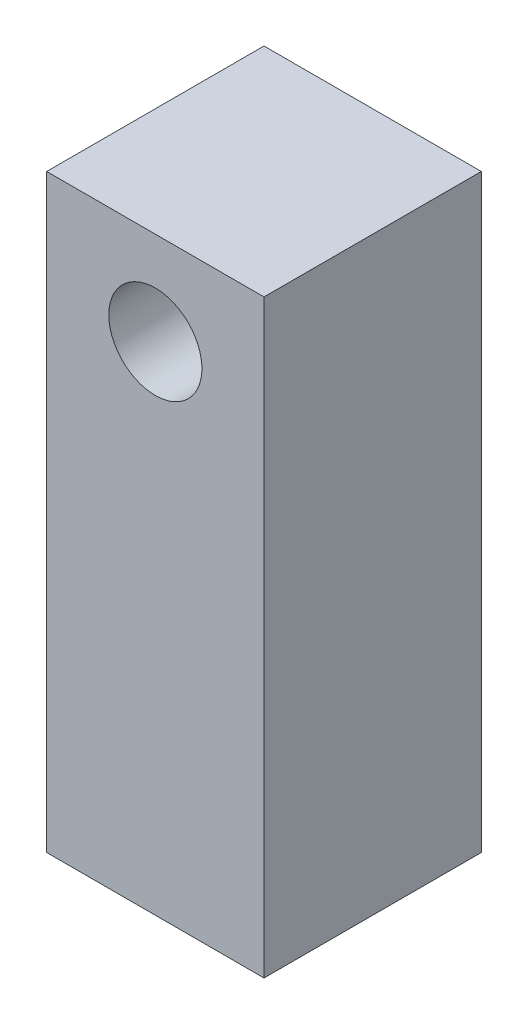
ISO-10303-21;
HEADER;
FILE_DESCRIPTION(('STEP AP214'),'2;1');
FILE_NAME('part.step','',(''),(''),'','','');
FILE_SCHEMA(('AUTOMOTIVE_DESIGN { 1 0 10303 214 1 1 1 1 }'));
ENDSEC;
DATA;
#1=APPLICATION_CONTEXT('core data for automotive mechanical design processes');
#2=APPLICATION_PROTOCOL_DEFINITION('international standard','automotive_design',2000,#1);
#3=PRODUCT_CONTEXT('',#1,'mechanical');
#4=PRODUCT('Part','Part','',(#3));
#5=PRODUCT_RELATED_PRODUCT_CATEGORY('part','',(#4));
#6=PRODUCT_DEFINITION_FORMATION('','',#4);
#7=PRODUCT_DEFINITION_CONTEXT('part definition',#1,'design');
#8=PRODUCT_DEFINITION('design','',#6,#7);
#9=PRODUCT_DEFINITION_SHAPE('','',#8);
#10=(LENGTH_UNIT() NAMED_UNIT(*) SI_UNIT(.MILLI.,.METRE.));
#11=(NAMED_UNIT(*) PLANE_ANGLE_UNIT() SI_UNIT($,.RADIAN.));
#12=(NAMED_UNIT(*) SI_UNIT($,.STERADIAN.) SOLID_ANGLE_UNIT());
#13=UNCERTAINTY_MEASURE_WITH_UNIT(LENGTH_MEASURE(1.E-05),#10,'distance_accuracy_value','');
#14=(GEOMETRIC_REPRESENTATION_CONTEXT(3) GLOBAL_UNCERTAINTY_ASSIGNED_CONTEXT((#13)) GLOBAL_UNIT_ASSIGNED_CONTEXT((#10,
#11,#12)) REPRESENTATION_CONTEXT('',''));
#15=CARTESIAN_POINT('',(0.,0.,0.));
#16=DIRECTION('',(0.,0.,1.));
#17=DIRECTION('',(1.,0.,0.));
#18=AXIS2_PLACEMENT_3D('',#15,#16,#17);
#19=CARTESIAN_POINT('',(0.,0.,0.));
#20=DIRECTION('',(0.,-1.,0.));
#21=DIRECTION('',(0.,0.,-1.));
#22=AXIS2_PLACEMENT_3D('',#19,#20,#21);
#23=PLANE('',#22);
#24=DIRECTION('',(0.,0.,-1.));
#25=VECTOR('',#24,1.);
#26=CARTESIAN_POINT('',(3.5,0.,3.5));
#27=LINE('',#26,#25);
#28=CARTESIAN_POINT('',(3.5,0.,3.5));
#29=VERTEX_POINT('',#28);
#30=CARTESIAN_POINT('',(3.5,0.,-3.5));
#31=VERTEX_POINT('',#30);
#32=EDGE_CURVE('E111',#29,#31,#27,.T.);
#33=ORIENTED_EDGE('',*,*,#32,.F.);
#34=DIRECTION('',(1.,0.,0.));
#35=VECTOR('',#34,1.);
#36=CARTESIAN_POINT('',(-3.5,0.,3.5));
#37=LINE('',#36,#35);
#38=CARTESIAN_POINT('',(-3.5,0.,3.5));
#39=VERTEX_POINT('',#38);
#40=EDGE_CURVE('E50',#39,#29,#37,.T.);
#41=ORIENTED_EDGE('',*,*,#40,.F.);
#42=DIRECTION('',(0.,0.,1.));
#43=VECTOR('',#42,1.);
#44=CARTESIAN_POINT('',(-3.5,0.,3.5));
#45=LINE('',#44,#43);
#46=CARTESIAN_POINT('',(-3.5,0.,-3.5));
#47=VERTEX_POINT('',#46);
#48=EDGE_CURVE('E58',#47,#39,#45,.T.);
#49=ORIENTED_EDGE('',*,*,#48,.F.);
#50=DIRECTION('',(-1.,0.,0.));
#51=VECTOR('',#50,1.);
#52=CARTESIAN_POINT('',(-3.5,0.,-3.5));
#53=LINE('',#52,#51);
#54=EDGE_CURVE('E81',#31,#47,#53,.T.);
#55=ORIENTED_EDGE('',*,*,#54,.F.);
#56=EDGE_LOOP('',(#33,#41,#49,#55));
#57=FACE_BOUND('',#56,.T.);
#58=CARTESIAN_POINT('',(0.,0.,0.));
#59=DIRECTION('',(0.,1.,0.));
#60=DIRECTION('',(0.,0.,1.));
#61=AXIS2_PLACEMENT_3D('',#58,#59,#60);
#62=CIRCLE('',#61,2.);
#63=CARTESIAN_POINT('',(0.,0.,2.));
#64=VERTEX_POINT('',#63);
#65=EDGE_CURVE('E108',#64,#64,#62,.T.);
#66=ORIENTED_EDGE('',*,*,#65,.T.);
#67=EDGE_LOOP('',(#66));
#68=FACE_BOUND('',#67,.T.);
#69=ADVANCED_FACE('F35',(#57,#68),#23,.T.);
#70=CARTESIAN_POINT('',(3.5,13.,3.5));
#71=DIRECTION('',(-1.,0.,0.));
#72=DIRECTION('',(0.,0.,1.));
#73=AXIS2_PLACEMENT_3D('',#70,#71,#72);
#74=PLANE('',#73);
#75=ORIENTED_EDGE('',*,*,#32,.T.);
#76=DIRECTION('',(0.,-1.,0.));
#77=VECTOR('',#76,1.);
#78=CARTESIAN_POINT('',(3.5,13.,-3.5));
#79=LINE('',#78,#77);
#80=CARTESIAN_POINT('',(3.5,19.,-3.5));
#81=VERTEX_POINT('',#80);
#82=EDGE_CURVE('E11',#81,#31,#79,.T.);
#83=ORIENTED_EDGE('',*,*,#82,.F.);
#84=DIRECTION('',(0.,0.,-1.));
#85=VECTOR('',#84,1.);
#86=CARTESIAN_POINT('',(3.5,19.,12.7195444572929));
#87=LINE('',#86,#85);
#88=CARTESIAN_POINT('',(3.5,19.,3.5));
#89=VERTEX_POINT('',#88);
#90=EDGE_CURVE('E90',#89,#81,#87,.T.);
#91=ORIENTED_EDGE('',*,*,#90,.F.);
#92=DIRECTION('',(0.,-1.,0.));
#93=VECTOR('',#92,1.);
#94=CARTESIAN_POINT('',(3.5,13.,3.5));
#95=LINE('',#94,#93);
#96=EDGE_CURVE('E117',#89,#29,#95,.T.);
#97=ORIENTED_EDGE('',*,*,#96,.T.);
#98=EDGE_LOOP('',(#75,#83,#91,#97));
#99=FACE_BOUND('',#98,.T.);
#100=ADVANCED_FACE('F37',(#99),#74,.F.);
#101=CARTESIAN_POINT('',(-3.5,13.,-3.5));
#102=DIRECTION('',(0.,0.,1.));
#103=DIRECTION('',(1.,0.,0.));
#104=AXIS2_PLACEMENT_3D('',#101,#102,#103);
#105=PLANE('',#104);
#106=ORIENTED_EDGE('',*,*,#54,.T.);
#107=DIRECTION('',(0.,-1.,0.));
#108=VECTOR('',#107,1.);
#109=CARTESIAN_POINT('',(-3.5,13.,-3.5));
#110=LINE('',#109,#108);
#111=CARTESIAN_POINT('',(-3.5,19.,-3.5));
#112=VERTEX_POINT('',#111);
#113=EDGE_CURVE('E43',#112,#47,#110,.T.);
#114=ORIENTED_EDGE('',*,*,#113,.F.);
#115=DIRECTION('',(1.,0.,0.));
#116=VECTOR('',#115,1.);
#117=CARTESIAN_POINT('',(-3.5,19.,-3.5));
#118=LINE('',#117,#116);
#119=EDGE_CURVE('E80',#112,#81,#118,.T.);
#120=ORIENTED_EDGE('',*,*,#119,.T.);
#121=ORIENTED_EDGE('',*,*,#82,.T.);
#122=EDGE_LOOP('',(#106,#114,#120,#121));
#123=FACE_BOUND('',#122,.T.);
#124=CARTESIAN_POINT('',(0.,16.,-3.5));
#125=DIRECTION('',(0.,0.,1.));
#126=DIRECTION('',(1.,0.,0.));
#127=AXIS2_PLACEMENT_3D('',#124,#125,#126);
#128=CIRCLE('',#127,1.5);
#129=CARTESIAN_POINT('',(1.5,16.,-3.5));
#130=VERTEX_POINT('',#129);
#131=EDGE_CURVE('E95',#130,#130,#128,.F.);
#132=ORIENTED_EDGE('',*,*,#131,.F.);
#133=EDGE_LOOP('',(#132));
#134=FACE_BOUND('',#133,.T.);
#135=ADVANCED_FACE('F77',(#123,#134),#105,.F.);
#136=CARTESIAN_POINT('',(-3.5,13.,3.5));
#137=DIRECTION('',(1.,0.,0.));
#138=DIRECTION('',(0.,0.,-1.));
#139=AXIS2_PLACEMENT_3D('',#136,#137,#138);
#140=PLANE('',#139);
#141=ORIENTED_EDGE('',*,*,#48,.T.);
#142=DIRECTION('',(0.,-1.,0.));
#143=VECTOR('',#142,1.);
#144=CARTESIAN_POINT('',(-3.5,13.,3.5));
#145=LINE('',#144,#143);
#146=CARTESIAN_POINT('',(-3.5,19.,3.5));
#147=VERTEX_POINT('',#146);
#148=EDGE_CURVE('E82',#147,#39,#145,.T.);
#149=ORIENTED_EDGE('',*,*,#148,.F.);
#150=DIRECTION('',(0.,0.,-1.));
#151=VECTOR('',#150,1.);
#152=CARTESIAN_POINT('',(-3.5,19.,12.7195444572929));
#153=LINE('',#152,#151);
#154=EDGE_CURVE('E84',#147,#112,#153,.T.);
#155=ORIENTED_EDGE('',*,*,#154,.T.);
#156=ORIENTED_EDGE('',*,*,#113,.T.);
#157=EDGE_LOOP('',(#141,#149,#155,#156));
#158=FACE_BOUND('',#157,.T.);
#159=ADVANCED_FACE('F85',(#158),#140,.F.);
#160=CARTESIAN_POINT('',(-3.5,13.,3.5));
#161=DIRECTION('',(0.,0.,-1.));
#162=DIRECTION('',(-1.,0.,0.));
#163=AXIS2_PLACEMENT_3D('',#160,#161,#162);
#164=PLANE('',#163);
#165=ORIENTED_EDGE('',*,*,#40,.T.);
#166=ORIENTED_EDGE('',*,*,#96,.F.);
#167=DIRECTION('',(1.,0.,0.));
#168=VECTOR('',#167,1.);
#169=CARTESIAN_POINT('',(-3.5,19.,3.5));
#170=LINE('',#169,#168);
#171=EDGE_CURVE('E98',#147,#89,#170,.T.);
#172=ORIENTED_EDGE('',*,*,#171,.F.);
#173=ORIENTED_EDGE('',*,*,#148,.T.);
#174=EDGE_LOOP('',(#165,#166,#172,#173));
#175=FACE_BOUND('',#174,.T.);
#176=CARTESIAN_POINT('',(0.,16.,3.5));
#177=DIRECTION('',(0.,0.,-1.));
#178=DIRECTION('',(-1.,0.,0.));
#179=AXIS2_PLACEMENT_3D('',#176,#177,#178);
#180=CIRCLE('',#179,1.5);
#181=CARTESIAN_POINT('',(-1.5,16.,3.5));
#182=VERTEX_POINT('',#181);
#183=EDGE_CURVE('E89',#182,#182,#180,.T.);
#184=ORIENTED_EDGE('',*,*,#183,.T.);
#185=EDGE_LOOP('',(#184));
#186=FACE_BOUND('',#185,.T.);
#187=ADVANCED_FACE('F119',(#175,#186),#164,.F.);
#188=CARTESIAN_POINT('',(0.,13.,0.));
#189=DIRECTION('',(0.,-1.,0.));
#190=DIRECTION('',(0.,0.,-1.));
#191=AXIS2_PLACEMENT_3D('',#188,#189,#190);
#192=CYLINDRICAL_SURFACE('',#191,2.);
#193=CARTESIAN_POINT('',(0.,13.,0.));
#194=DIRECTION('',(0.,1.,0.));
#195=DIRECTION('',(0.,0.,1.));
#196=AXIS2_PLACEMENT_3D('',#193,#194,#195);
#197=CIRCLE('',#196,2.);
#198=CARTESIAN_POINT('',(0.,13.,2.));
#199=VERTEX_POINT('',#198);
#200=EDGE_CURVE('E105',#199,#199,#197,.T.);
#201=ORIENTED_EDGE('',*,*,#200,.T.);
#202=EDGE_LOOP('',(#201));
#203=FACE_BOUND('',#202,.T.);
#204=ORIENTED_EDGE('',*,*,#65,.F.);
#205=EDGE_LOOP('',(#204));
#206=FACE_BOUND('',#205,.T.);
#207=ADVANCED_FACE('F135',(#203,#206),#192,.F.);
#208=CARTESIAN_POINT('',(-3.5,13.,12.7195444572929));
#209=DIRECTION('',(0.,1.,0.));
#210=DIRECTION('',(0.,0.,1.));
#211=AXIS2_PLACEMENT_3D('',#208,#209,#210);
#212=PLANE('',#211);
#213=ORIENTED_EDGE('',*,*,#200,.F.);
#214=EDGE_LOOP('',(#213));
#215=FACE_BOUND('',#214,.T.);
#216=ADVANCED_FACE('F155',(#215),#212,.F.);
#217=CARTESIAN_POINT('',(-3.5,19.,12.7195444572929));
#218=DIRECTION('',(0.,-1.,0.));
#219=DIRECTION('',(0.,0.,-1.));
#220=AXIS2_PLACEMENT_3D('',#217,#218,#219);
#221=PLANE('',#220);
#222=ORIENTED_EDGE('',*,*,#154,.F.);
#223=ORIENTED_EDGE('',*,*,#171,.T.);
#224=ORIENTED_EDGE('',*,*,#90,.T.);
#225=ORIENTED_EDGE('',*,*,#119,.F.);
#226=EDGE_LOOP('',(#222,#223,#224,#225));
#227=FACE_BOUND('',#226,.T.);
#228=ADVANCED_FACE('F93',(#227),#221,.F.);
#229=CARTESIAN_POINT('',(0.,16.,12.7195444572929));
#230=DIRECTION('',(0.,0.,-1.));
#231=DIRECTION('',(-1.,0.,0.));
#232=AXIS2_PLACEMENT_3D('',#229,#230,#231);
#233=CYLINDRICAL_SURFACE('',#232,1.5);
#234=ORIENTED_EDGE('',*,*,#183,.F.);
#235=EDGE_LOOP('',(#234));
#236=FACE_BOUND('',#235,.T.);
#237=ORIENTED_EDGE('',*,*,#131,.T.);
#238=EDGE_LOOP('',(#237));
#239=FACE_BOUND('',#238,.T.);
#240=ADVANCED_FACE('F168',(#236,#239),#233,.F.);
#241=CLOSED_SHELL('',(#69,#100,#135,#159,#187,#207,#216,#228,#240));
#242=MANIFOLD_SOLID_BREP('B2',#241);
#243=ADVANCED_BREP_SHAPE_REPRESENTATION('',(#18,#242),#14);
#244=SHAPE_DEFINITION_REPRESENTATION(#9,#243);
ENDSEC;
END-ISO-10303-21;
